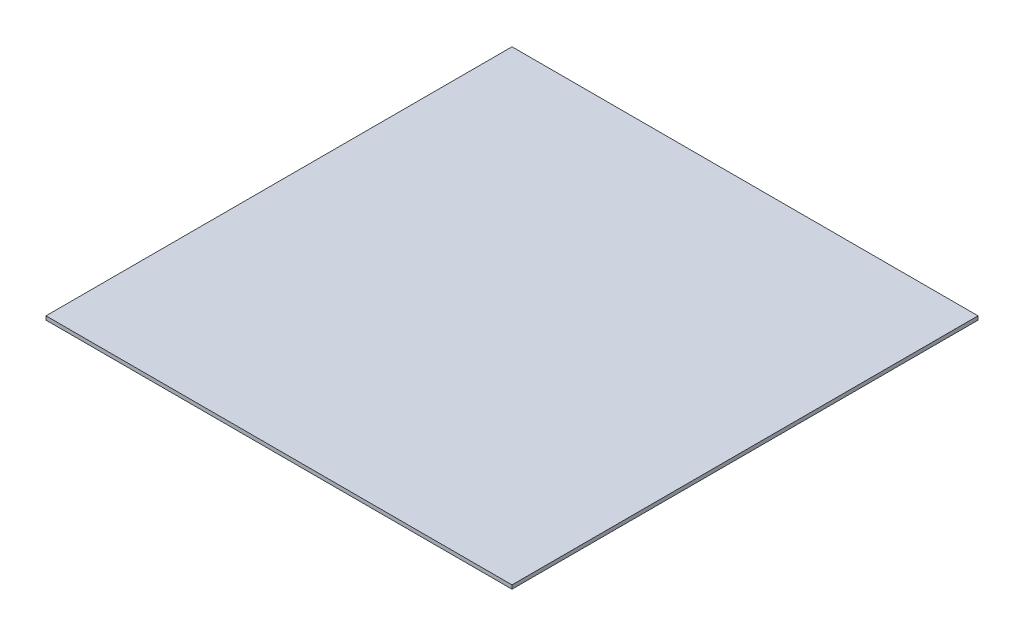
ISO-10303-21;
HEADER;
FILE_DESCRIPTION(('STEP AP214'),'2;1');
FILE_NAME('part.step','',(''),(''),'','','');
FILE_SCHEMA(('AUTOMOTIVE_DESIGN { 1 0 10303 214 1 1 1 1 }'));
ENDSEC;
DATA;
#1=APPLICATION_CONTEXT('core data for automotive mechanical design processes');
#2=APPLICATION_PROTOCOL_DEFINITION('international standard','automotive_design',2000,#1);
#3=PRODUCT_CONTEXT('',#1,'mechanical');
#4=PRODUCT('Part','Part','',(#3));
#5=PRODUCT_RELATED_PRODUCT_CATEGORY('part','',(#4));
#6=PRODUCT_DEFINITION_FORMATION('','',#4);
#7=PRODUCT_DEFINITION_CONTEXT('part definition',#1,'design');
#8=PRODUCT_DEFINITION('design','',#6,#7);
#9=PRODUCT_DEFINITION_SHAPE('','',#8);
#10=(LENGTH_UNIT() NAMED_UNIT(*) SI_UNIT(.MILLI.,.METRE.));
#11=(NAMED_UNIT(*) PLANE_ANGLE_UNIT() SI_UNIT($,.RADIAN.));
#12=(NAMED_UNIT(*) SI_UNIT($,.STERADIAN.) SOLID_ANGLE_UNIT());
#13=UNCERTAINTY_MEASURE_WITH_UNIT(LENGTH_MEASURE(1.E-05),#10,'distance_accuracy_value','');
#14=(GEOMETRIC_REPRESENTATION_CONTEXT(3) GLOBAL_UNCERTAINTY_ASSIGNED_CONTEXT((#13)) GLOBAL_UNIT_ASSIGNED_CONTEXT((#10,
#11,#12)) REPRESENTATION_CONTEXT('',''));
#15=CARTESIAN_POINT('',(0.,0.,0.));
#16=DIRECTION('',(0.,0.,1.));
#17=DIRECTION('',(1.,0.,0.));
#18=AXIS2_PLACEMENT_3D('',#15,#16,#17);
#19=CARTESIAN_POINT('',(185.,3.,185.));
#20=DIRECTION('',(-1.,0.,0.));
#21=DIRECTION('',(0.,0.,1.));
#22=AXIS2_PLACEMENT_3D('',#19,#20,#21);
#23=PLANE('',#22);
#24=DIRECTION('',(0.,0.,-1.));
#25=VECTOR('',#24,1.);
#26=CARTESIAN_POINT('',(185.,0.,185.));
#27=LINE('',#26,#25);
#28=CARTESIAN_POINT('',(185.,0.,185.));
#29=VERTEX_POINT('',#28);
#30=CARTESIAN_POINT('',(185.,0.,-185.));
#31=VERTEX_POINT('',#30);
#32=EDGE_CURVE('E107',#29,#31,#27,.T.);
#33=ORIENTED_EDGE('',*,*,#32,.T.);
#34=DIRECTION('',(0.,-1.,0.));
#35=VECTOR('',#34,1.);
#36=CARTESIAN_POINT('',(185.,3.,-185.));
#37=LINE('',#36,#35);
#38=CARTESIAN_POINT('',(185.,3.,-185.));
#39=VERTEX_POINT('',#38);
#40=EDGE_CURVE('E11',#39,#31,#37,.T.);
#41=ORIENTED_EDGE('',*,*,#40,.F.);
#42=DIRECTION('',(0.,0.,-1.));
#43=VECTOR('',#42,1.);
#44=CARTESIAN_POINT('',(185.,3.,185.));
#45=LINE('',#44,#43);
#46=CARTESIAN_POINT('',(185.,3.,185.));
#47=VERTEX_POINT('',#46);
#48=EDGE_CURVE('E91',#47,#39,#45,.T.);
#49=ORIENTED_EDGE('',*,*,#48,.F.);
#50=DIRECTION('',(0.,-1.,0.));
#51=VECTOR('',#50,1.);
#52=CARTESIAN_POINT('',(185.,3.,185.));
#53=LINE('',#52,#51);
#54=EDGE_CURVE('E103',#47,#29,#53,.T.);
#55=ORIENTED_EDGE('',*,*,#54,.T.);
#56=EDGE_LOOP('',(#33,#41,#49,#55));
#57=FACE_BOUND('',#56,.T.);
#58=ADVANCED_FACE('F39',(#57),#23,.F.);
#59=CARTESIAN_POINT('',(-185.,3.,-185.));
#60=DIRECTION('',(0.,0.,1.));
#61=DIRECTION('',(1.,0.,0.));
#62=AXIS2_PLACEMENT_3D('',#59,#60,#61);
#63=PLANE('',#62);
#64=DIRECTION('',(-1.,0.,0.));
#65=VECTOR('',#64,1.);
#66=CARTESIAN_POINT('',(-185.,0.,-185.));
#67=LINE('',#66,#65);
#68=CARTESIAN_POINT('',(-185.,0.,-185.));
#69=VERTEX_POINT('',#68);
#70=EDGE_CURVE('E96',#31,#69,#67,.T.);
#71=ORIENTED_EDGE('',*,*,#70,.T.);
#72=DIRECTION('',(0.,-1.,0.));
#73=VECTOR('',#72,1.);
#74=CARTESIAN_POINT('',(-185.,3.,-185.));
#75=LINE('',#74,#73);
#76=CARTESIAN_POINT('',(-185.,3.,-185.));
#77=VERTEX_POINT('',#76);
#78=EDGE_CURVE('E48',#77,#69,#75,.T.);
#79=ORIENTED_EDGE('',*,*,#78,.F.);
#80=DIRECTION('',(-1.,0.,0.));
#81=VECTOR('',#80,1.);
#82=CARTESIAN_POINT('',(-185.,3.,-185.));
#83=LINE('',#82,#81);
#84=EDGE_CURVE('E86',#39,#77,#83,.T.);
#85=ORIENTED_EDGE('',*,*,#84,.F.);
#86=ORIENTED_EDGE('',*,*,#40,.T.);
#87=EDGE_LOOP('',(#71,#79,#85,#86));
#88=FACE_BOUND('',#87,.T.);
#89=ADVANCED_FACE('F95',(#88),#63,.F.);
#90=CARTESIAN_POINT('',(-185.,3.,185.));
#91=DIRECTION('',(1.,0.,0.));
#92=DIRECTION('',(0.,0.,-1.));
#93=AXIS2_PLACEMENT_3D('',#90,#91,#92);
#94=PLANE('',#93);
#95=DIRECTION('',(0.,0.,1.));
#96=VECTOR('',#95,1.);
#97=CARTESIAN_POINT('',(-185.,0.,185.));
#98=LINE('',#97,#96);
#99=CARTESIAN_POINT('',(-185.,0.,185.));
#100=VERTEX_POINT('',#99);
#101=EDGE_CURVE('E73',#69,#100,#98,.T.);
#102=ORIENTED_EDGE('',*,*,#101,.T.);
#103=DIRECTION('',(0.,-1.,0.));
#104=VECTOR('',#103,1.);
#105=CARTESIAN_POINT('',(-185.,3.,185.));
#106=LINE('',#105,#104);
#107=CARTESIAN_POINT('',(-185.,3.,185.));
#108=VERTEX_POINT('',#107);
#109=EDGE_CURVE('E98',#108,#100,#106,.T.);
#110=ORIENTED_EDGE('',*,*,#109,.F.);
#111=DIRECTION('',(0.,0.,1.));
#112=VECTOR('',#111,1.);
#113=CARTESIAN_POINT('',(-185.,3.,185.));
#114=LINE('',#113,#112);
#115=EDGE_CURVE('E89',#77,#108,#114,.T.);
#116=ORIENTED_EDGE('',*,*,#115,.F.);
#117=ORIENTED_EDGE('',*,*,#78,.T.);
#118=EDGE_LOOP('',(#102,#110,#116,#117));
#119=FACE_BOUND('',#118,.T.);
#120=ADVANCED_FACE('F99',(#119),#94,.F.);
#121=CARTESIAN_POINT('',(-185.,3.,185.));
#122=DIRECTION('',(0.,0.,-1.));
#123=DIRECTION('',(-1.,0.,0.));
#124=AXIS2_PLACEMENT_3D('',#121,#122,#123);
#125=PLANE('',#124);
#126=DIRECTION('',(1.,0.,0.));
#127=VECTOR('',#126,1.);
#128=CARTESIAN_POINT('',(-185.,0.,185.));
#129=LINE('',#128,#127);
#130=EDGE_CURVE('E79',#100,#29,#129,.T.);
#131=ORIENTED_EDGE('',*,*,#130,.T.);
#132=ORIENTED_EDGE('',*,*,#54,.F.);
#133=DIRECTION('',(1.,0.,0.));
#134=VECTOR('',#133,1.);
#135=CARTESIAN_POINT('',(-185.,3.,185.));
#136=LINE('',#135,#134);
#137=EDGE_CURVE('E56',#108,#47,#136,.T.);
#138=ORIENTED_EDGE('',*,*,#137,.F.);
#139=ORIENTED_EDGE('',*,*,#109,.T.);
#140=EDGE_LOOP('',(#131,#132,#138,#139));
#141=FACE_BOUND('',#140,.T.);
#142=ADVANCED_FACE('F120',(#141),#125,.F.);
#143=CARTESIAN_POINT('',(0.,3.,0.));
#144=DIRECTION('',(0.,-1.,0.));
#145=DIRECTION('',(0.,0.,-1.));
#146=AXIS2_PLACEMENT_3D('',#143,#144,#145);
#147=PLANE('',#146);
#148=ORIENTED_EDGE('',*,*,#48,.T.);
#149=ORIENTED_EDGE('',*,*,#84,.T.);
#150=ORIENTED_EDGE('',*,*,#115,.T.);
#151=ORIENTED_EDGE('',*,*,#137,.T.);
#152=EDGE_LOOP('',(#148,#149,#150,#151));
#153=FACE_BOUND('',#152,.T.);
#154=ADVANCED_FACE('F87',(#153),#147,.F.);
#155=CARTESIAN_POINT('',(0.,0.,0.));
#156=DIRECTION('',(0.,-1.,0.));
#157=DIRECTION('',(0.,0.,-1.));
#158=AXIS2_PLACEMENT_3D('',#155,#156,#157);
#159=PLANE('',#158);
#160=ORIENTED_EDGE('',*,*,#32,.F.);
#161=ORIENTED_EDGE('',*,*,#130,.F.);
#162=ORIENTED_EDGE('',*,*,#101,.F.);
#163=ORIENTED_EDGE('',*,*,#70,.F.);
#164=EDGE_LOOP('',(#160,#161,#162,#163));
#165=FACE_BOUND('',#164,.T.);
#166=ADVANCED_FACE('F123',(#165),#159,.T.);
#167=CLOSED_SHELL('',(#58,#89,#120,#142,#154,#166));
#168=MANIFOLD_SOLID_BREP('B2',#167);
#169=ADVANCED_BREP_SHAPE_REPRESENTATION('',(#18,#168),#14);
#170=SHAPE_DEFINITION_REPRESENTATION(#9,#169);
ENDSEC;
END-ISO-10303-21;
